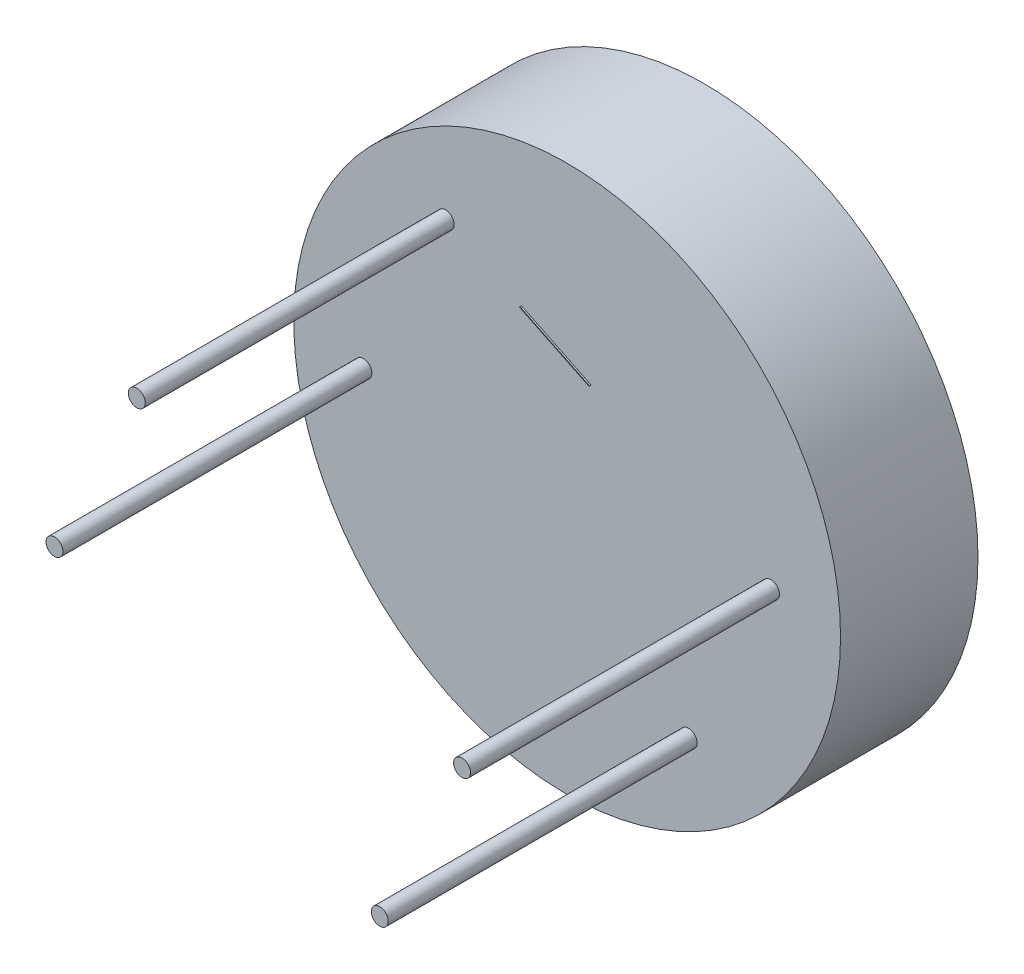
ISO-10303-21;
HEADER;
FILE_DESCRIPTION(('STEP AP214'),'2;1');
FILE_NAME('part.step','',(''),(''),'','','');
FILE_SCHEMA(('AUTOMOTIVE_DESIGN { 1 0 10303 214 1 1 1 1 }'));
ENDSEC;
DATA;
#1=APPLICATION_CONTEXT('core data for automotive mechanical design processes');
#2=APPLICATION_PROTOCOL_DEFINITION('international standard','automotive_design',2000,#1);
#3=PRODUCT_CONTEXT('',#1,'mechanical');
#4=PRODUCT('Part','Part','',(#3));
#5=PRODUCT_RELATED_PRODUCT_CATEGORY('part','',(#4));
#6=PRODUCT_DEFINITION_FORMATION('','',#4);
#7=PRODUCT_DEFINITION_CONTEXT('part definition',#1,'design');
#8=PRODUCT_DEFINITION('design','',#6,#7);
#9=PRODUCT_DEFINITION_SHAPE('','',#8);
#10=(LENGTH_UNIT() NAMED_UNIT(*) SI_UNIT(.MILLI.,.METRE.));
#11=(NAMED_UNIT(*) PLANE_ANGLE_UNIT() SI_UNIT($,.RADIAN.));
#12=(NAMED_UNIT(*) SI_UNIT($,.STERADIAN.) SOLID_ANGLE_UNIT());
#13=UNCERTAINTY_MEASURE_WITH_UNIT(LENGTH_MEASURE(1.E-05),#10,'distance_accuracy_value','');
#14=(GEOMETRIC_REPRESENTATION_CONTEXT(3) GLOBAL_UNCERTAINTY_ASSIGNED_CONTEXT((#13)) GLOBAL_UNIT_ASSIGNED_CONTEXT((#10,
#11,#12)) REPRESENTATION_CONTEXT('',''));
#15=CARTESIAN_POINT('',(0.,0.,0.));
#16=DIRECTION('',(0.,0.,1.));
#17=DIRECTION('',(1.,0.,0.));
#18=AXIS2_PLACEMENT_3D('',#15,#16,#17);
#19=CARTESIAN_POINT('',(0.,0.,89.));
#20=DIRECTION('',(0.,0.,1.));
#21=DIRECTION('',(1.,0.,0.));
#22=AXIS2_PLACEMENT_3D('',#19,#20,#21);
#23=PLANE('',#22);
#24=CARTESIAN_POINT('',(-78.648083604085,106.011692493823,89.));
#25=DIRECTION('',(0.,0.,1.));
#26=DIRECTION('',(1.,0.,0.));
#27=AXIS2_PLACEMENT_3D('',#24,#25,#26);
#28=CIRCLE('',#27,5.5);
#29=CARTESIAN_POINT('',(-73.148083604085,106.011692493823,89.));
#30=VERTEX_POINT('',#29);
#31=EDGE_CURVE('E110',#30,#30,#28,.T.);
#32=ORIENTED_EDGE('',*,*,#31,.F.);
#33=EDGE_LOOP('',(#32));
#34=FACE_BOUND('',#33,.T.);
#35=CARTESIAN_POINT('',(131.939733981982,3.98830750617709,89.));
#36=DIRECTION('',(0.,0.,1.));
#37=DIRECTION('',(1.,0.,0.));
#38=AXIS2_PLACEMENT_3D('',#35,#36,#37);
#39=CIRCLE('',#38,5.50000000000002);
#40=CARTESIAN_POINT('',(137.439733981982,3.98830750617709,89.));
#41=VERTEX_POINT('',#40);
#42=EDGE_CURVE('E114',#41,#41,#39,.T.);
#43=ORIENTED_EDGE('',*,*,#42,.F.);
#44=EDGE_LOOP('',(#43));
#45=FACE_BOUND('',#44,.T.);
#46=CARTESIAN_POINT('',(78.6480836040849,-106.011692493823,89.));
#47=DIRECTION('',(0.,0.,1.));
#48=DIRECTION('',(1.,0.,0.));
#49=AXIS2_PLACEMENT_3D('',#46,#47,#48);
#50=CIRCLE('',#49,5.5);
#51=CARTESIAN_POINT('',(84.1480836040849,-106.011692493823,89.));
#52=VERTEX_POINT('',#51);
#53=EDGE_CURVE('E120',#52,#52,#50,.T.);
#54=ORIENTED_EDGE('',*,*,#53,.F.);
#55=EDGE_LOOP('',(#54));
#56=FACE_BOUND('',#55,.T.);
#57=CARTESIAN_POINT('',(-131.939733981982,-3.98830750617713,89.));
#58=DIRECTION('',(0.,0.,1.));
#59=DIRECTION('',(1.,0.,0.));
#60=AXIS2_PLACEMENT_3D('',#57,#58,#59);
#61=CIRCLE('',#60,5.50000000000002);
#62=CARTESIAN_POINT('',(-126.439733981982,-3.98830750617713,89.));
#63=VERTEX_POINT('',#62);
#64=EDGE_CURVE('E126',#63,#63,#61,.T.);
#65=ORIENTED_EDGE('',*,*,#64,.F.);
#66=EDGE_LOOP('',(#65));
#67=FACE_BOUND('',#66,.T.);
#68=CARTESIAN_POINT('',(0.,0.,89.));
#69=DIRECTION('',(0.,0.,1.));
#70=DIRECTION('',(1.,0.,0.));
#71=AXIS2_PLACEMENT_3D('',#68,#69,#70);
#72=CIRCLE('',#71,177.);
#73=CARTESIAN_POINT('',(177.,0.,89.));
#74=VERTEX_POINT('',#73);
#75=EDGE_CURVE('E11',#74,#74,#72,.T.);
#76=ORIENTED_EDGE('',*,*,#75,.T.);
#77=EDGE_LOOP('',(#76));
#78=FACE_BOUND('',#77,.T.);
#79=DIRECTION('',(-0.435997371742076,-0.899947938401995,0.));
#80=VECTOR('',#79,1.);
#81=CARTESIAN_POINT('',(-29.64052976233,82.2690249919068,89.));
#82=LINE('',#81,#80);
#83=CARTESIAN_POINT('',(-29.64052976233,82.2690249919068,89.));
#84=VERTEX_POINT('',#83);
#85=CARTESIAN_POINT('',(-29.8585284482011,81.8190510227058,89.));
#86=VERTEX_POINT('',#85);
#87=EDGE_CURVE('E89',#84,#86,#82,.T.);
#88=ORIENTED_EDGE('',*,*,#87,.F.);
#89=DIRECTION('',(-0.899947938401995,0.435997371742076,0.));
#90=VECTOR('',#89,1.);
#91=CARTESIAN_POINT('',(15.3568671577697,60.469156404803,89.));
#92=LINE('',#91,#90);
#93=CARTESIAN_POINT('',(15.3568671577697,60.469156404803,89.));
#94=VERTEX_POINT('',#93);
#95=EDGE_CURVE('E100',#94,#84,#92,.T.);
#96=ORIENTED_EDGE('',*,*,#95,.F.);
#97=DIRECTION('',(0.435997371742075,0.899947938401996,0.));
#98=VECTOR('',#97,1.);
#99=CARTESIAN_POINT('',(15.1388684718987,60.019182435602,89.));
#100=LINE('',#99,#98);
#101=CARTESIAN_POINT('',(15.1388684718987,60.019182435602,89.));
#102=VERTEX_POINT('',#101);
#103=EDGE_CURVE('E70',#102,#94,#100,.T.);
#104=ORIENTED_EDGE('',*,*,#103,.F.);
#105=DIRECTION('',(0.899947938401996,-0.435997371742075,0.));
#106=VECTOR('',#105,1.);
#107=CARTESIAN_POINT('',(-29.8585284482011,81.8190510227058,89.));
#108=LINE('',#107,#106);
#109=EDGE_CURVE('E104',#86,#102,#108,.T.);
#110=ORIENTED_EDGE('',*,*,#109,.F.);
#111=EDGE_LOOP('',(#88,#96,#104,#110));
#112=FACE_BOUND('',#111,.T.);
#113=ADVANCED_FACE('F33',(#34,#45,#56,#67,#78,#112),#23,.T.);
#114=CARTESIAN_POINT('',(0.,0.,89.));
#115=DIRECTION('',(0.,0.,-1.));
#116=DIRECTION('',(-1.,0.,0.));
#117=AXIS2_PLACEMENT_3D('',#114,#115,#116);
#118=CYLINDRICAL_SURFACE('',#117,177.);
#119=ORIENTED_EDGE('',*,*,#75,.F.);
#120=EDGE_LOOP('',(#119));
#121=FACE_BOUND('',#120,.T.);
#122=CARTESIAN_POINT('',(0.,0.,0.));
#123=DIRECTION('',(0.,0.,1.));
#124=DIRECTION('',(1.,0.,0.));
#125=AXIS2_PLACEMENT_3D('',#122,#123,#124);
#126=CIRCLE('',#125,177.);
#127=CARTESIAN_POINT('',(177.,0.,0.));
#128=VERTEX_POINT('',#127);
#129=EDGE_CURVE('E37',#128,#128,#126,.T.);
#130=ORIENTED_EDGE('',*,*,#129,.T.);
#131=EDGE_LOOP('',(#130));
#132=FACE_BOUND('',#131,.T.);
#133=ADVANCED_FACE('F35',(#121,#132),#118,.T.);
#134=CARTESIAN_POINT('',(0.,0.,0.));
#135=DIRECTION('',(0.,0.,1.));
#136=DIRECTION('',(1.,0.,0.));
#137=AXIS2_PLACEMENT_3D('',#134,#135,#136);
#138=PLANE('',#137);
#139=ORIENTED_EDGE('',*,*,#129,.F.);
#140=EDGE_LOOP('',(#139));
#141=FACE_BOUND('',#140,.T.);
#142=ADVANCED_FACE('F189',(#141),#138,.F.);
#143=CARTESIAN_POINT('',(-131.939733981982,-3.98830750617713,289.));
#144=DIRECTION('',(0.,0.,-1.));
#145=DIRECTION('',(-1.,0.,0.));
#146=AXIS2_PLACEMENT_3D('',#143,#144,#145);
#147=CYLINDRICAL_SURFACE('',#146,5.50000000000002);
#148=CARTESIAN_POINT('',(-131.939733981982,-3.98830750617713,289.));
#149=DIRECTION('',(0.,0.,1.));
#150=DIRECTION('',(1.,0.,0.));
#151=AXIS2_PLACEMENT_3D('',#148,#149,#150);
#152=CIRCLE('',#151,5.50000000000002);
#153=CARTESIAN_POINT('',(-126.439733981982,-3.98830750617713,289.));
#154=VERTEX_POINT('',#153);
#155=EDGE_CURVE('E129',#154,#154,#152,.T.);
#156=ORIENTED_EDGE('',*,*,#155,.F.);
#157=EDGE_LOOP('',(#156));
#158=FACE_BOUND('',#157,.T.);
#159=ORIENTED_EDGE('',*,*,#64,.T.);
#160=EDGE_LOOP('',(#159));
#161=FACE_BOUND('',#160,.T.);
#162=ADVANCED_FACE('F135',(#158,#161),#147,.T.);
#163=CARTESIAN_POINT('',(-131.939733981982,-3.98830750617713,289.));
#164=DIRECTION('',(0.,0.,1.));
#165=DIRECTION('',(1.,0.,0.));
#166=AXIS2_PLACEMENT_3D('',#163,#164,#165);
#167=PLANE('',#166);
#168=ORIENTED_EDGE('',*,*,#155,.T.);
#169=EDGE_LOOP('',(#168));
#170=FACE_BOUND('',#169,.T.);
#171=ADVANCED_FACE('F183',(#170),#167,.T.);
#172=CARTESIAN_POINT('',(78.6480836040849,-106.011692493823,289.));
#173=DIRECTION('',(0.,0.,-1.));
#174=DIRECTION('',(-1.,0.,0.));
#175=AXIS2_PLACEMENT_3D('',#172,#173,#174);
#176=CYLINDRICAL_SURFACE('',#175,5.5);
#177=CARTESIAN_POINT('',(78.6480836040849,-106.011692493823,289.));
#178=DIRECTION('',(0.,0.,1.));
#179=DIRECTION('',(1.,0.,0.));
#180=AXIS2_PLACEMENT_3D('',#177,#178,#179);
#181=CIRCLE('',#180,5.5);
#182=CARTESIAN_POINT('',(84.1480836040849,-106.011692493823,289.));
#183=VERTEX_POINT('',#182);
#184=EDGE_CURVE('E123',#183,#183,#181,.T.);
#185=ORIENTED_EDGE('',*,*,#184,.F.);
#186=EDGE_LOOP('',(#185));
#187=FACE_BOUND('',#186,.T.);
#188=ORIENTED_EDGE('',*,*,#53,.T.);
#189=EDGE_LOOP('',(#188));
#190=FACE_BOUND('',#189,.T.);
#191=ADVANCED_FACE('F179',(#187,#190),#176,.T.);
#192=CARTESIAN_POINT('',(78.6480836040849,-106.011692493823,289.));
#193=DIRECTION('',(0.,0.,1.));
#194=DIRECTION('',(1.,0.,0.));
#195=AXIS2_PLACEMENT_3D('',#192,#193,#194);
#196=PLANE('',#195);
#197=ORIENTED_EDGE('',*,*,#184,.T.);
#198=EDGE_LOOP('',(#197));
#199=FACE_BOUND('',#198,.T.);
#200=ADVANCED_FACE('F175',(#199),#196,.T.);
#201=CARTESIAN_POINT('',(131.939733981982,3.98830750617709,289.));
#202=DIRECTION('',(0.,0.,-1.));
#203=DIRECTION('',(-1.,0.,0.));
#204=AXIS2_PLACEMENT_3D('',#201,#202,#203);
#205=CYLINDRICAL_SURFACE('',#204,5.50000000000002);
#206=CARTESIAN_POINT('',(131.939733981982,3.98830750617709,289.));
#207=DIRECTION('',(0.,0.,1.));
#208=DIRECTION('',(1.,0.,0.));
#209=AXIS2_PLACEMENT_3D('',#206,#207,#208);
#210=CIRCLE('',#209,5.50000000000002);
#211=CARTESIAN_POINT('',(137.439733981982,3.98830750617709,289.));
#212=VERTEX_POINT('',#211);
#213=EDGE_CURVE('E117',#212,#212,#210,.T.);
#214=ORIENTED_EDGE('',*,*,#213,.F.);
#215=EDGE_LOOP('',(#214));
#216=FACE_BOUND('',#215,.T.);
#217=ORIENTED_EDGE('',*,*,#42,.T.);
#218=EDGE_LOOP('',(#217));
#219=FACE_BOUND('',#218,.T.);
#220=ADVANCED_FACE('F171',(#216,#219),#205,.T.);
#221=CARTESIAN_POINT('',(131.939733981982,3.98830750617709,289.));
#222=DIRECTION('',(0.,0.,1.));
#223=DIRECTION('',(1.,0.,0.));
#224=AXIS2_PLACEMENT_3D('',#221,#222,#223);
#225=PLANE('',#224);
#226=ORIENTED_EDGE('',*,*,#213,.T.);
#227=EDGE_LOOP('',(#226));
#228=FACE_BOUND('',#227,.T.);
#229=ADVANCED_FACE('F167',(#228),#225,.T.);
#230=CARTESIAN_POINT('',(-78.648083604085,106.011692493823,289.));
#231=DIRECTION('',(0.,0.,-1.));
#232=DIRECTION('',(-1.,0.,0.));
#233=AXIS2_PLACEMENT_3D('',#230,#231,#232);
#234=CYLINDRICAL_SURFACE('',#233,5.5);
#235=CARTESIAN_POINT('',(-78.648083604085,106.011692493823,289.));
#236=DIRECTION('',(0.,0.,1.));
#237=DIRECTION('',(1.,0.,0.));
#238=AXIS2_PLACEMENT_3D('',#235,#236,#237);
#239=CIRCLE('',#238,5.5);
#240=CARTESIAN_POINT('',(-73.148083604085,106.011692493823,289.));
#241=VERTEX_POINT('',#240);
#242=EDGE_CURVE('E111',#241,#241,#239,.T.);
#243=ORIENTED_EDGE('',*,*,#242,.F.);
#244=EDGE_LOOP('',(#243));
#245=FACE_BOUND('',#244,.T.);
#246=ORIENTED_EDGE('',*,*,#31,.T.);
#247=EDGE_LOOP('',(#246));
#248=FACE_BOUND('',#247,.T.);
#249=ADVANCED_FACE('F163',(#245,#248),#234,.T.);
#250=CARTESIAN_POINT('',(-78.648083604085,106.011692493823,289.));
#251=DIRECTION('',(0.,0.,1.));
#252=DIRECTION('',(1.,0.,0.));
#253=AXIS2_PLACEMENT_3D('',#250,#251,#252);
#254=PLANE('',#253);
#255=ORIENTED_EDGE('',*,*,#242,.T.);
#256=EDGE_LOOP('',(#255));
#257=FACE_BOUND('',#256,.T.);
#258=ADVANCED_FACE('F160',(#257),#254,.T.);
#259=CARTESIAN_POINT('',(15.3568671577697,60.469156404803,90.));
#260=DIRECTION('',(-0.435997371742076,-0.899947938401995,0.));
#261=DIRECTION('',(0.899947938401995,-0.435997371742076,0.));
#262=AXIS2_PLACEMENT_3D('',#259,#260,#261);
#263=PLANE('',#262);
#264=ORIENTED_EDGE('',*,*,#95,.T.);
#265=DIRECTION('',(0.,0.,-1.));
#266=VECTOR('',#265,1.);
#267=CARTESIAN_POINT('',(-29.64052976233,82.2690249919068,90.));
#268=LINE('',#267,#266);
#269=CARTESIAN_POINT('',(-29.64052976233,82.2690249919068,90.));
#270=VERTEX_POINT('',#269);
#271=EDGE_CURVE('E92',#270,#84,#268,.T.);
#272=ORIENTED_EDGE('',*,*,#271,.F.);
#273=DIRECTION('',(-0.899947938401995,0.435997371742076,0.));
#274=VECTOR('',#273,1.);
#275=CARTESIAN_POINT('',(15.3568671577697,60.469156404803,90.));
#276=LINE('',#275,#274);
#277=CARTESIAN_POINT('',(15.3568671577697,60.469156404803,90.));
#278=VERTEX_POINT('',#277);
#279=EDGE_CURVE('E82',#278,#270,#276,.T.);
#280=ORIENTED_EDGE('',*,*,#279,.F.);
#281=DIRECTION('',(0.,0.,-1.));
#282=VECTOR('',#281,1.);
#283=CARTESIAN_POINT('',(15.3568671577697,60.469156404803,90.));
#284=LINE('',#283,#282);
#285=EDGE_CURVE('E96',#278,#94,#284,.T.);
#286=ORIENTED_EDGE('',*,*,#285,.T.);
#287=EDGE_LOOP('',(#264,#272,#280,#286));
#288=FACE_BOUND('',#287,.T.);
#289=ADVANCED_FACE('F145',(#288),#263,.F.);
#290=CARTESIAN_POINT('',(-29.64052976233,82.2690249919068,90.));
#291=DIRECTION('',(0.899947938401995,-0.435997371742076,0.));
#292=DIRECTION('',(0.435997371742076,0.899947938401996,0.));
#293=AXIS2_PLACEMENT_3D('',#290,#291,#292);
#294=PLANE('',#293);
#295=ORIENTED_EDGE('',*,*,#87,.T.);
#296=DIRECTION('',(0.,0.,-1.));
#297=VECTOR('',#296,1.);
#298=CARTESIAN_POINT('',(-29.8585284482011,81.8190510227058,90.));
#299=LINE('',#298,#297);
#300=CARTESIAN_POINT('',(-29.8585284482011,81.8190510227058,90.));
#301=VERTEX_POINT('',#300);
#302=EDGE_CURVE('E86',#301,#86,#299,.T.);
#303=ORIENTED_EDGE('',*,*,#302,.F.);
#304=DIRECTION('',(-0.435997371742076,-0.899947938401995,0.));
#305=VECTOR('',#304,1.);
#306=CARTESIAN_POINT('',(-29.64052976233,82.2690249919068,90.));
#307=LINE('',#306,#305);
#308=EDGE_CURVE('E77',#270,#301,#307,.T.);
#309=ORIENTED_EDGE('',*,*,#308,.F.);
#310=ORIENTED_EDGE('',*,*,#271,.T.);
#311=EDGE_LOOP('',(#295,#303,#309,#310));
#312=FACE_BOUND('',#311,.T.);
#313=ADVANCED_FACE('F87',(#312),#294,.F.);
#314=CARTESIAN_POINT('',(-29.8585284482011,81.8190510227058,90.));
#315=DIRECTION('',(0.435997371742075,0.899947938401996,0.));
#316=DIRECTION('',(-0.899947938401996,0.435997371742075,0.));
#317=AXIS2_PLACEMENT_3D('',#314,#315,#316);
#318=PLANE('',#317);
#319=ORIENTED_EDGE('',*,*,#109,.T.);
#320=DIRECTION('',(0.,0.,-1.));
#321=VECTOR('',#320,1.);
#322=CARTESIAN_POINT('',(15.1388684718987,60.019182435602,90.));
#323=LINE('',#322,#321);
#324=CARTESIAN_POINT('',(15.1388684718987,60.019182435602,90.));
#325=VERTEX_POINT('',#324);
#326=EDGE_CURVE('E48',#325,#102,#323,.T.);
#327=ORIENTED_EDGE('',*,*,#326,.F.);
#328=DIRECTION('',(0.899947938401996,-0.435997371742075,0.));
#329=VECTOR('',#328,1.);
#330=CARTESIAN_POINT('',(-29.8585284482011,81.8190510227058,90.));
#331=LINE('',#330,#329);
#332=EDGE_CURVE('E80',#301,#325,#331,.T.);
#333=ORIENTED_EDGE('',*,*,#332,.F.);
#334=ORIENTED_EDGE('',*,*,#302,.T.);
#335=EDGE_LOOP('',(#319,#327,#333,#334));
#336=FACE_BOUND('',#335,.T.);
#337=ADVANCED_FACE('F94',(#336),#318,.F.);
#338=CARTESIAN_POINT('',(15.1388684718987,60.019182435602,90.));
#339=DIRECTION('',(-0.899947938401996,0.435997371742075,0.));
#340=DIRECTION('',(-0.435997371742075,-0.899947938401996,0.));
#341=AXIS2_PLACEMENT_3D('',#338,#339,#340);
#342=PLANE('',#341);
#343=ORIENTED_EDGE('',*,*,#103,.T.);
#344=ORIENTED_EDGE('',*,*,#285,.F.);
#345=DIRECTION('',(0.435997371742075,0.899947938401996,0.));
#346=VECTOR('',#345,1.);
#347=CARTESIAN_POINT('',(15.1388684718987,60.019182435602,90.));
#348=LINE('',#347,#346);
#349=EDGE_CURVE('E56',#325,#278,#348,.T.);
#350=ORIENTED_EDGE('',*,*,#349,.F.);
#351=ORIENTED_EDGE('',*,*,#326,.T.);
#352=EDGE_LOOP('',(#343,#344,#350,#351));
#353=FACE_BOUND('',#352,.T.);
#354=ADVANCED_FACE('F146',(#353),#342,.F.);
#355=CARTESIAN_POINT('',(0.,0.,90.));
#356=DIRECTION('',(0.,0.,1.));
#357=DIRECTION('',(1.,0.,0.));
#358=AXIS2_PLACEMENT_3D('',#355,#356,#357);
#359=PLANE('',#358);
#360=ORIENTED_EDGE('',*,*,#279,.T.);
#361=ORIENTED_EDGE('',*,*,#308,.T.);
#362=ORIENTED_EDGE('',*,*,#332,.T.);
#363=ORIENTED_EDGE('',*,*,#349,.T.);
#364=EDGE_LOOP('',(#360,#361,#362,#363));
#365=FACE_BOUND('',#364,.T.);
#366=ADVANCED_FACE('F78',(#365),#359,.T.);
#367=CLOSED_SHELL('',(#113,#133,#142,#162,#171,#191,#200,#220,#229,#249,#258,#289,#313,#337,
#354,#366));
#368=MANIFOLD_SOLID_BREP('B2',#367);
#369=ADVANCED_BREP_SHAPE_REPRESENTATION('',(#18,#368),#14);
#370=SHAPE_DEFINITION_REPRESENTATION(#9,#369);
ENDSEC;
END-ISO-10303-21;
